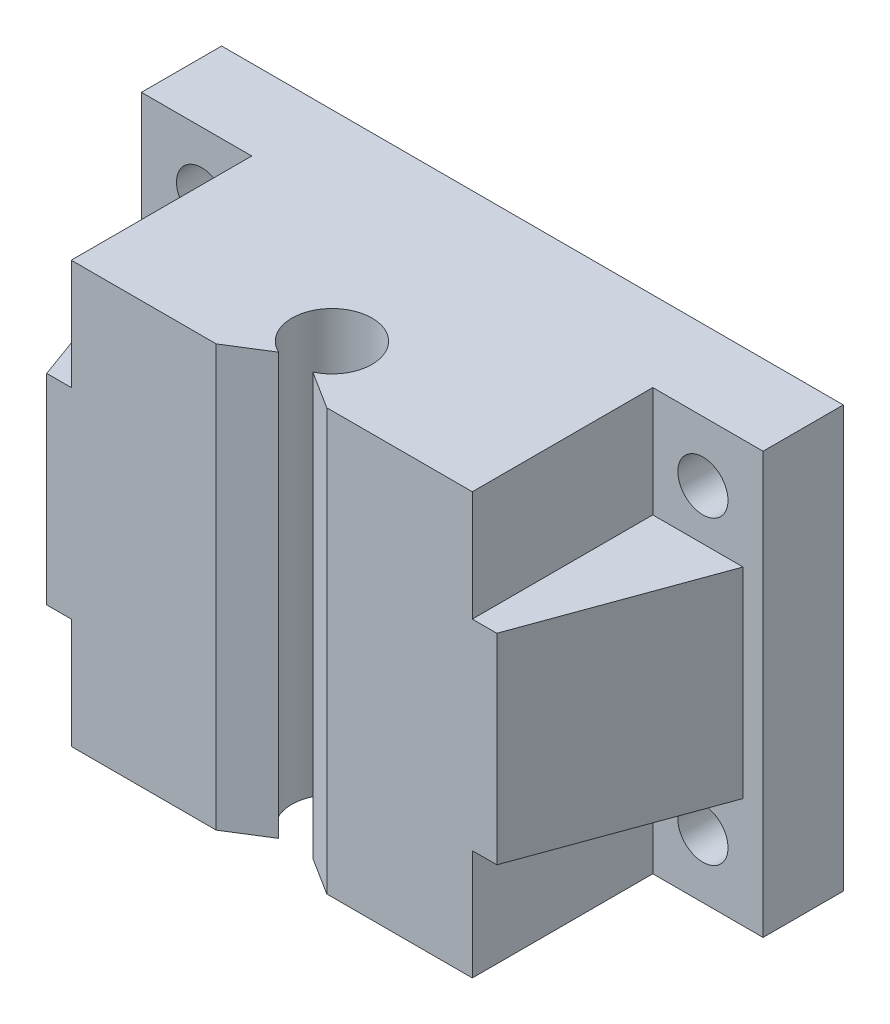
ISO-10303-21;
HEADER;
FILE_DESCRIPTION(('STEP AP214'),'2;1');
FILE_NAME('part.step','',(''),(''),'','','');
FILE_SCHEMA(('AUTOMOTIVE_DESIGN { 1 0 10303 214 1 1 1 1 }'));
ENDSEC;
DATA;
#1=APPLICATION_CONTEXT('core data for automotive mechanical design processes');
#2=APPLICATION_PROTOCOL_DEFINITION('international standard','automotive_design',2000,#1);
#3=PRODUCT_CONTEXT('',#1,'mechanical');
#4=PRODUCT('Part','Part','',(#3));
#5=PRODUCT_RELATED_PRODUCT_CATEGORY('part','',(#4));
#6=PRODUCT_DEFINITION_FORMATION('','',#4);
#7=PRODUCT_DEFINITION_CONTEXT('part definition',#1,'design');
#8=PRODUCT_DEFINITION('design','',#6,#7);
#9=PRODUCT_DEFINITION_SHAPE('','',#8);
#10=(LENGTH_UNIT() NAMED_UNIT(*) SI_UNIT(.MILLI.,.METRE.));
#11=(NAMED_UNIT(*) PLANE_ANGLE_UNIT() SI_UNIT($,.RADIAN.));
#12=(NAMED_UNIT(*) SI_UNIT($,.STERADIAN.) SOLID_ANGLE_UNIT());
#13=UNCERTAINTY_MEASURE_WITH_UNIT(LENGTH_MEASURE(1.E-05),#10,'distance_accuracy_value','');
#14=(GEOMETRIC_REPRESENTATION_CONTEXT(3) GLOBAL_UNCERTAINTY_ASSIGNED_CONTEXT((#13)) GLOBAL_UNIT_ASSIGNED_CONTEXT((#10,
#11,#12)) REPRESENTATION_CONTEXT('',''));
#15=CARTESIAN_POINT('',(0.,0.,0.));
#16=DIRECTION('',(0.,0.,1.));
#17=DIRECTION('',(1.,0.,0.));
#18=AXIS2_PLACEMENT_3D('',#15,#16,#17);
#19=CARTESIAN_POINT('',(-20.,-21.,0.));
#20=DIRECTION('',(-1.,0.,0.));
#21=DIRECTION('',(0.,0.,1.));
#22=AXIS2_PLACEMENT_3D('',#19,#20,#21);
#23=PLANE('',#22);
#24=DIRECTION('',(0.,1.,0.));
#25=VECTOR('',#24,1.);
#26=CARTESIAN_POINT('',(-20.,-21.,22.));
#27=LINE('',#26,#25);
#28=CARTESIAN_POINT('',(-20.,-21.,22.));
#29=VERTEX_POINT('',#28);
#30=CARTESIAN_POINT('',(-20.,-10.,22.));
#31=VERTEX_POINT('',#30);
#32=EDGE_CURVE('E64',#29,#31,#27,.T.);
#33=ORIENTED_EDGE('',*,*,#32,.T.);
#34=DIRECTION('',(0.,0.,1.));
#35=VECTOR('',#34,1.);
#36=CARTESIAN_POINT('',(-20.,-10.,0.));
#37=LINE('',#36,#35);
#38=CARTESIAN_POINT('',(-20.,-10.,4.));
#39=VERTEX_POINT('',#38);
#40=EDGE_CURVE('E214',#39,#31,#37,.T.);
#41=ORIENTED_EDGE('',*,*,#40,.F.);
#42=DIRECTION('',(0.,1.,0.));
#43=VECTOR('',#42,1.);
#44=CARTESIAN_POINT('',(-20.,-21.,4.));
#45=LINE('',#44,#43);
#46=CARTESIAN_POINT('',(-20.,-21.,4.));
#47=VERTEX_POINT('',#46);
#48=EDGE_CURVE('E313',#47,#39,#45,.T.);
#49=ORIENTED_EDGE('',*,*,#48,.F.);
#50=DIRECTION('',(0.,0.,1.));
#51=VECTOR('',#50,1.);
#52=CARTESIAN_POINT('',(-20.,-21.,0.));
#53=LINE('',#52,#51);
#54=EDGE_CURVE('E304',#47,#29,#53,.T.);
#55=ORIENTED_EDGE('',*,*,#54,.T.);
#56=EDGE_LOOP('',(#33,#41,#49,#55));
#57=FACE_BOUND('',#56,.T.);
#58=ADVANCED_FACE('F39',(#57),#23,.T.);
#59=CARTESIAN_POINT('',(0.,-21.,4.));
#60=DIRECTION('',(0.,0.,1.));
#61=DIRECTION('',(1.,0.,0.));
#62=AXIS2_PLACEMENT_3D('',#59,#60,#61);
#63=PLANE('',#62);
#64=CARTESIAN_POINT('',(-25.,15.,4.));
#65=DIRECTION('',(0.,0.,1.));
#66=DIRECTION('',(1.,0.,0.));
#67=AXIS2_PLACEMENT_3D('',#64,#65,#66);
#68=CIRCLE('',#67,2.5);
#69=CARTESIAN_POINT('',(-22.5,15.,4.));
#70=VERTEX_POINT('',#69);
#71=EDGE_CURVE('E562',#70,#70,#68,.F.);
#72=ORIENTED_EDGE('',*,*,#71,.T.);
#73=EDGE_LOOP('',(#72));
#74=FACE_BOUND('',#73,.T.);
#75=CARTESIAN_POINT('',(-25.,-15.,4.));
#76=DIRECTION('',(0.,0.,1.));
#77=DIRECTION('',(1.,0.,0.));
#78=AXIS2_PLACEMENT_3D('',#75,#76,#77);
#79=CIRCLE('',#78,2.5);
#80=CARTESIAN_POINT('',(-22.5,-15.,4.));
#81=VERTEX_POINT('',#80);
#82=EDGE_CURVE('E571',#81,#81,#79,.F.);
#83=ORIENTED_EDGE('',*,*,#82,.T.);
#84=EDGE_LOOP('',(#83));
#85=FACE_BOUND('',#84,.T.);
#86=ORIENTED_EDGE('',*,*,#48,.T.);
#87=DIRECTION('',(1.,0.,0.));
#88=VECTOR('',#87,1.);
#89=CARTESIAN_POINT('',(0.,-10.,4.));
#90=LINE('',#89,#88);
#91=CARTESIAN_POINT('',(-29.,-10.,4.));
#92=VERTEX_POINT('',#91);
#93=EDGE_CURVE('E191',#92,#39,#90,.T.);
#94=ORIENTED_EDGE('',*,*,#93,.F.);
#95=DIRECTION('',(0.,1.,0.));
#96=VECTOR('',#95,1.);
#97=CARTESIAN_POINT('',(-29.,-10.,4.));
#98=LINE('',#97,#96);
#99=CARTESIAN_POINT('',(-29.,10.,4.));
#100=VERTEX_POINT('',#99);
#101=EDGE_CURVE('E190',#92,#100,#98,.T.);
#102=ORIENTED_EDGE('',*,*,#101,.T.);
#103=DIRECTION('',(1.,0.,0.));
#104=VECTOR('',#103,1.);
#105=CARTESIAN_POINT('',(0.,10.,4.));
#106=LINE('',#105,#104);
#107=CARTESIAN_POINT('',(-20.,9.99999999999999,4.));
#108=VERTEX_POINT('',#107);
#109=EDGE_CURVE('E201',#100,#108,#106,.T.);
#110=ORIENTED_EDGE('',*,*,#109,.T.);
#111=CARTESIAN_POINT('',(-20.,21.,4.));
#112=VERTEX_POINT('',#111);
#113=EDGE_CURVE('E316',#108,#112,#45,.T.);
#114=ORIENTED_EDGE('',*,*,#113,.T.);
#115=DIRECTION('',(1.,0.,0.));
#116=VECTOR('',#115,1.);
#117=CARTESIAN_POINT('',(0.,21.,4.));
#118=LINE('',#117,#116);
#119=CARTESIAN_POINT('',(-31.,21.,4.));
#120=VERTEX_POINT('',#119);
#121=EDGE_CURVE('E268',#120,#112,#118,.T.);
#122=ORIENTED_EDGE('',*,*,#121,.F.);
#123=DIRECTION('',(0.,1.,0.));
#124=VECTOR('',#123,1.);
#125=CARTESIAN_POINT('',(-31.,-21.,4.));
#126=LINE('',#125,#124);
#127=CARTESIAN_POINT('',(-31.,-21.,4.));
#128=VERTEX_POINT('',#127);
#129=EDGE_CURVE('E317',#128,#120,#126,.T.);
#130=ORIENTED_EDGE('',*,*,#129,.F.);
#131=DIRECTION('',(1.,0.,0.));
#132=VECTOR('',#131,1.);
#133=CARTESIAN_POINT('',(0.,-21.,4.));
#134=LINE('',#133,#132);
#135=EDGE_CURVE('E301',#128,#47,#134,.T.);
#136=ORIENTED_EDGE('',*,*,#135,.T.);
#137=EDGE_LOOP('',(#86,#94,#102,#110,#114,#122,#130,#136));
#138=FACE_BOUND('',#137,.T.);
#139=ADVANCED_FACE('F385',(#74,#85,#138),#63,.T.);
#140=CARTESIAN_POINT('',(0.,-21.,4.));
#141=DIRECTION('',(0.,0.,1.));
#142=DIRECTION('',(1.,0.,0.));
#143=AXIS2_PLACEMENT_3D('',#140,#141,#142);
#144=PLANE('',#143);
#145=CARTESIAN_POINT('',(25.,-15.,4.));
#146=DIRECTION('',(0.,0.,1.));
#147=DIRECTION('',(1.,0.,0.));
#148=AXIS2_PLACEMENT_3D('',#145,#146,#147);
#149=CIRCLE('',#148,2.5);
#150=CARTESIAN_POINT('',(27.5,-15.,4.));
#151=VERTEX_POINT('',#150);
#152=EDGE_CURVE('E576',#151,#151,#149,.F.);
#153=ORIENTED_EDGE('',*,*,#152,.T.);
#154=EDGE_LOOP('',(#153));
#155=FACE_BOUND('',#154,.T.);
#156=CARTESIAN_POINT('',(25.,15.,4.));
#157=DIRECTION('',(0.,0.,1.));
#158=DIRECTION('',(1.,0.,0.));
#159=AXIS2_PLACEMENT_3D('',#156,#157,#158);
#160=CIRCLE('',#159,2.5);
#161=CARTESIAN_POINT('',(27.5,15.,4.));
#162=VERTEX_POINT('',#161);
#163=EDGE_CURVE('E205',#162,#162,#160,.F.);
#164=ORIENTED_EDGE('',*,*,#163,.T.);
#165=EDGE_LOOP('',(#164));
#166=FACE_BOUND('',#165,.T.);
#167=DIRECTION('',(0.,1.,0.));
#168=VECTOR('',#167,1.);
#169=CARTESIAN_POINT('',(29.,-10.,4.));
#170=LINE('',#169,#168);
#171=CARTESIAN_POINT('',(29.,-10.,4.));
#172=VERTEX_POINT('',#171);
#173=CARTESIAN_POINT('',(29.,10.,4.));
#174=VERTEX_POINT('',#173);
#175=EDGE_CURVE('E241',#172,#174,#170,.T.);
#176=ORIENTED_EDGE('',*,*,#175,.F.);
#177=DIRECTION('',(1.,0.,0.));
#178=VECTOR('',#177,1.);
#179=CARTESIAN_POINT('',(0.,-10.,4.));
#180=LINE('',#179,#178);
#181=CARTESIAN_POINT('',(20.,-10.,4.));
#182=VERTEX_POINT('',#181);
#183=EDGE_CURVE('E238',#182,#172,#180,.T.);
#184=ORIENTED_EDGE('',*,*,#183,.F.);
#185=DIRECTION('',(0.,1.,0.));
#186=VECTOR('',#185,1.);
#187=CARTESIAN_POINT('',(20.,-21.,4.));
#188=LINE('',#187,#186);
#189=CARTESIAN_POINT('',(20.,-21.,4.));
#190=VERTEX_POINT('',#189);
#191=EDGE_CURVE('E325',#190,#182,#188,.T.);
#192=ORIENTED_EDGE('',*,*,#191,.F.);
#193=DIRECTION('',(1.,0.,0.));
#194=VECTOR('',#193,1.);
#195=CARTESIAN_POINT('',(0.,-21.,4.));
#196=LINE('',#195,#194);
#197=CARTESIAN_POINT('',(31.,-21.,4.));
#198=VERTEX_POINT('',#197);
#199=EDGE_CURVE('E291',#190,#198,#196,.T.);
#200=ORIENTED_EDGE('',*,*,#199,.T.);
#201=DIRECTION('',(0.,1.,0.));
#202=VECTOR('',#201,1.);
#203=CARTESIAN_POINT('',(31.,-21.,4.));
#204=LINE('',#203,#202);
#205=CARTESIAN_POINT('',(31.,21.,4.));
#206=VERTEX_POINT('',#205);
#207=EDGE_CURVE('E323',#198,#206,#204,.T.);
#208=ORIENTED_EDGE('',*,*,#207,.T.);
#209=DIRECTION('',(1.,0.,0.));
#210=VECTOR('',#209,1.);
#211=CARTESIAN_POINT('',(0.,21.,4.));
#212=LINE('',#211,#210);
#213=CARTESIAN_POINT('',(20.,21.,4.));
#214=VERTEX_POINT('',#213);
#215=EDGE_CURVE('E256',#214,#206,#212,.T.);
#216=ORIENTED_EDGE('',*,*,#215,.F.);
#217=CARTESIAN_POINT('',(20.,10.,4.));
#218=VERTEX_POINT('',#217);
#219=EDGE_CURVE('E328',#218,#214,#188,.T.);
#220=ORIENTED_EDGE('',*,*,#219,.F.);
#221=DIRECTION('',(1.,0.,0.));
#222=VECTOR('',#221,1.);
#223=CARTESIAN_POINT('',(0.,10.,4.));
#224=LINE('',#223,#222);
#225=EDGE_CURVE('E227',#218,#174,#224,.T.);
#226=ORIENTED_EDGE('',*,*,#225,.T.);
#227=EDGE_LOOP('',(#176,#184,#192,#200,#208,#216,#220,#226));
#228=FACE_BOUND('',#227,.T.);
#229=ADVANCED_FACE('F367',(#155,#166,#228),#144,.T.);
#230=CARTESIAN_POINT('',(20.,-21.,0.));
#231=DIRECTION('',(-1.,0.,0.));
#232=DIRECTION('',(0.,0.,1.));
#233=AXIS2_PLACEMENT_3D('',#230,#231,#232);
#234=PLANE('',#233);
#235=DIRECTION('',(0.,0.,1.));
#236=VECTOR('',#235,1.);
#237=CARTESIAN_POINT('',(20.,-10.,0.));
#238=LINE('',#237,#236);
#239=CARTESIAN_POINT('',(20.,-10.,22.));
#240=VERTEX_POINT('',#239);
#241=EDGE_CURVE('E230',#182,#240,#238,.T.);
#242=ORIENTED_EDGE('',*,*,#241,.T.);
#243=DIRECTION('',(0.,1.,0.));
#244=VECTOR('',#243,1.);
#245=CARTESIAN_POINT('',(20.,-21.,22.));
#246=LINE('',#245,#244);
#247=CARTESIAN_POINT('',(20.,-21.,22.));
#248=VERTEX_POINT('',#247);
#249=EDGE_CURVE('E329',#248,#240,#246,.T.);
#250=ORIENTED_EDGE('',*,*,#249,.F.);
#251=DIRECTION('',(0.,0.,1.));
#252=VECTOR('',#251,1.);
#253=CARTESIAN_POINT('',(20.,-21.,0.));
#254=LINE('',#253,#252);
#255=EDGE_CURVE('E289',#190,#248,#254,.T.);
#256=ORIENTED_EDGE('',*,*,#255,.F.);
#257=ORIENTED_EDGE('',*,*,#191,.T.);
#258=EDGE_LOOP('',(#242,#250,#256,#257));
#259=FACE_BOUND('',#258,.T.);
#260=ADVANCED_FACE('F405',(#259),#234,.F.);
#261=CARTESIAN_POINT('',(0.,-21.,16.));
#262=DIRECTION('',(0.,1.,0.));
#263=DIRECTION('',(0.,0.,1.));
#264=AXIS2_PLACEMENT_3D('',#261,#262,#263);
#265=CYLINDRICAL_SURFACE('',#264,4.);
#266=DIRECTION('',(0.,1.,0.));
#267=VECTOR('',#266,1.);
#268=CARTESIAN_POINT('',(1.70882809611771,-21.,19.6166153428197));
#269=LINE('',#268,#267);
#270=CARTESIAN_POINT('',(1.70882809611771,-21.,19.6166153428197));
#271=VERTEX_POINT('',#270);
#272=CARTESIAN_POINT('',(1.70882809611771,21.,19.6166153428197));
#273=VERTEX_POINT('',#272);
#274=EDGE_CURVE('E43',#271,#273,#269,.T.);
#275=ORIENTED_EDGE('',*,*,#274,.T.);
#276=CARTESIAN_POINT('',(0.,21.,16.));
#277=DIRECTION('',(0.,1.,0.));
#278=DIRECTION('',(0.,0.,1.));
#279=AXIS2_PLACEMENT_3D('',#276,#277,#278);
#280=CIRCLE('',#279,4.);
#281=CARTESIAN_POINT('',(-1.72457910656757,21.,19.6091310457215));
#282=VERTEX_POINT('',#281);
#283=EDGE_CURVE('E243',#273,#282,#280,.T.);
#284=ORIENTED_EDGE('',*,*,#283,.T.);
#285=DIRECTION('',(0.,1.,0.));
#286=VECTOR('',#285,1.);
#287=CARTESIAN_POINT('',(-1.72457910656757,-21.,19.6091310457215));
#288=LINE('',#287,#286);
#289=CARTESIAN_POINT('',(-1.72457910656757,-21.,19.6091310457215));
#290=VERTEX_POINT('',#289);
#291=EDGE_CURVE('E11',#290,#282,#288,.T.);
#292=ORIENTED_EDGE('',*,*,#291,.F.);
#293=CARTESIAN_POINT('',(0.,-21.,16.));
#294=DIRECTION('',(0.,1.,0.));
#295=DIRECTION('',(0.,0.,1.));
#296=AXIS2_PLACEMENT_3D('',#293,#294,#295);
#297=CIRCLE('',#296,4.);
#298=EDGE_CURVE('E280',#271,#290,#297,.T.);
#299=ORIENTED_EDGE('',*,*,#298,.F.);
#300=EDGE_LOOP('',(#275,#284,#292,#299));
#301=FACE_BOUND('',#300,.T.);
#302=ADVANCED_FACE('F41',(#301),#265,.F.);
#303=CARTESIAN_POINT('',(8.3312649876136,-21.,13.3190503029269));
#304=DIRECTION('',(-0.530312841304763,0.,-0.847802034880354));
#305=DIRECTION('',(-0.847802034880354,0.,0.530312841304763));
#306=AXIS2_PLACEMENT_3D('',#303,#304,#305);
#307=PLANE('',#306);
#308=ORIENTED_EDGE('',*,*,#291,.T.);
#309=DIRECTION('',(-0.847802034880354,0.,0.530312841304763));
#310=VECTOR('',#309,1.);
#311=CARTESIAN_POINT('',(8.3312649876136,21.,13.3190503029269));
#312=LINE('',#311,#310);
#313=CARTESIAN_POINT('',(-5.54682025687137,21.,22.));
#314=VERTEX_POINT('',#313);
#315=EDGE_CURVE('E277',#282,#314,#312,.T.);
#316=ORIENTED_EDGE('',*,*,#315,.T.);
#317=DIRECTION('',(0.,1.,0.));
#318=VECTOR('',#317,1.);
#319=CARTESIAN_POINT('',(-5.54682025687137,-21.,22.));
#320=LINE('',#319,#318);
#321=CARTESIAN_POINT('',(-5.54682025687137,-21.,22.));
#322=VERTEX_POINT('',#321);
#323=EDGE_CURVE('E48',#322,#314,#320,.T.);
#324=ORIENTED_EDGE('',*,*,#323,.F.);
#325=DIRECTION('',(-0.847802034880354,0.,0.530312841304763));
#326=VECTOR('',#325,1.);
#327=CARTESIAN_POINT('',(8.3312649876136,-21.,13.3190503029269));
#328=LINE('',#327,#326);
#329=EDGE_CURVE('E309',#290,#322,#328,.T.);
#330=ORIENTED_EDGE('',*,*,#329,.F.);
#331=EDGE_LOOP('',(#308,#316,#324,#330));
#332=FACE_BOUND('',#331,.T.);
#333=ADVANCED_FACE('F347',(#332),#307,.F.);
#334=CARTESIAN_POINT('',(0.,-21.,22.));
#335=DIRECTION('',(0.,0.,1.));
#336=DIRECTION('',(1.,0.,0.));
#337=AXIS2_PLACEMENT_3D('',#334,#335,#336);
#338=PLANE('',#337);
#339=ORIENTED_EDGE('',*,*,#323,.T.);
#340=DIRECTION('',(1.,0.,0.));
#341=VECTOR('',#340,1.);
#342=CARTESIAN_POINT('',(0.,21.,22.));
#343=LINE('',#342,#341);
#344=CARTESIAN_POINT('',(-20.,21.,22.));
#345=VERTEX_POINT('',#344);
#346=EDGE_CURVE('E274',#345,#314,#343,.T.);
#347=ORIENTED_EDGE('',*,*,#346,.F.);
#348=CARTESIAN_POINT('',(-20.,9.99999999999999,22.));
#349=VERTEX_POINT('',#348);
#350=EDGE_CURVE('E197',#349,#345,#27,.T.);
#351=ORIENTED_EDGE('',*,*,#350,.F.);
#352=DIRECTION('',(1.,0.,0.));
#353=VECTOR('',#352,1.);
#354=CARTESIAN_POINT('',(0.,10.,22.));
#355=LINE('',#354,#353);
#356=CARTESIAN_POINT('',(-22.4485357832084,10.,22.));
#357=VERTEX_POINT('',#356);
#358=EDGE_CURVE('E194',#357,#349,#355,.T.);
#359=ORIENTED_EDGE('',*,*,#358,.F.);
#360=DIRECTION('',(0.,1.,0.));
#361=VECTOR('',#360,1.);
#362=CARTESIAN_POINT('',(-22.4485357832084,-10.,22.));
#363=LINE('',#362,#361);
#364=CARTESIAN_POINT('',(-22.4485357832084,-10.,22.));
#365=VERTEX_POINT('',#364);
#366=EDGE_CURVE('E178',#365,#357,#363,.T.);
#367=ORIENTED_EDGE('',*,*,#366,.F.);
#368=DIRECTION('',(1.,0.,0.));
#369=VECTOR('',#368,1.);
#370=CARTESIAN_POINT('',(0.,-10.,22.));
#371=LINE('',#370,#369);
#372=EDGE_CURVE('E212',#365,#31,#371,.T.);
#373=ORIENTED_EDGE('',*,*,#372,.T.);
#374=ORIENTED_EDGE('',*,*,#32,.F.);
#375=DIRECTION('',(1.,0.,0.));
#376=VECTOR('',#375,1.);
#377=CARTESIAN_POINT('',(0.,-21.,22.));
#378=LINE('',#377,#376);
#379=EDGE_CURVE('E306',#29,#322,#378,.T.);
#380=ORIENTED_EDGE('',*,*,#379,.T.);
#381=EDGE_LOOP('',(#339,#347,#351,#359,#367,#373,#374,#380));
#382=FACE_BOUND('',#381,.T.);
#383=ADVANCED_FACE('F195',(#382),#338,.T.);
#384=DIRECTION('',(0.,0.,1.));
#385=VECTOR('',#384,1.);
#386=CARTESIAN_POINT('',(-20.,10.,0.));
#387=LINE('',#386,#385);
#388=EDGE_CURVE('E56',#108,#349,#387,.T.);
#389=ORIENTED_EDGE('',*,*,#388,.T.);
#390=ORIENTED_EDGE('',*,*,#350,.T.);
#391=DIRECTION('',(0.,0.,1.));
#392=VECTOR('',#391,1.);
#393=CARTESIAN_POINT('',(-20.,21.,0.));
#394=LINE('',#393,#392);
#395=EDGE_CURVE('E271',#112,#345,#394,.T.);
#396=ORIENTED_EDGE('',*,*,#395,.F.);
#397=ORIENTED_EDGE('',*,*,#113,.F.);
#398=EDGE_LOOP('',(#389,#390,#396,#397));
#399=FACE_BOUND('',#398,.T.);
#400=ADVANCED_FACE('F387',(#399),#23,.T.);
#401=CARTESIAN_POINT('',(-31.,-21.,0.));
#402=DIRECTION('',(1.,0.,0.));
#403=DIRECTION('',(0.,0.,-1.));
#404=AXIS2_PLACEMENT_3D('',#401,#402,#403);
#405=PLANE('',#404);
#406=ORIENTED_EDGE('',*,*,#129,.T.);
#407=DIRECTION('',(0.,0.,-1.));
#408=VECTOR('',#407,1.);
#409=CARTESIAN_POINT('',(-31.,21.,0.));
#410=LINE('',#409,#408);
#411=CARTESIAN_POINT('',(-31.,21.,-4.));
#412=VERTEX_POINT('',#411);
#413=EDGE_CURVE('E265',#120,#412,#410,.T.);
#414=ORIENTED_EDGE('',*,*,#413,.T.);
#415=DIRECTION('',(0.,1.,0.));
#416=VECTOR('',#415,1.);
#417=CARTESIAN_POINT('',(-31.,-21.,-4.));
#418=LINE('',#417,#416);
#419=CARTESIAN_POINT('',(-31.,-21.,-4.));
#420=VERTEX_POINT('',#419);
#421=EDGE_CURVE('E319',#420,#412,#418,.T.);
#422=ORIENTED_EDGE('',*,*,#421,.F.);
#423=DIRECTION('',(0.,0.,-1.));
#424=VECTOR('',#423,1.);
#425=CARTESIAN_POINT('',(-31.,-21.,0.));
#426=LINE('',#425,#424);
#427=EDGE_CURVE('E299',#128,#420,#426,.T.);
#428=ORIENTED_EDGE('',*,*,#427,.F.);
#429=EDGE_LOOP('',(#406,#414,#422,#428));
#430=FACE_BOUND('',#429,.T.);
#431=ADVANCED_FACE('F380',(#430),#405,.F.);
#432=CARTESIAN_POINT('',(0.,-21.,-4.));
#433=DIRECTION('',(0.,0.,1.));
#434=DIRECTION('',(1.,0.,0.));
#435=AXIS2_PLACEMENT_3D('',#432,#433,#434);
#436=PLANE('',#435);
#437=CARTESIAN_POINT('',(-25.,15.,-4.));
#438=DIRECTION('',(0.,0.,-1.));
#439=DIRECTION('',(-1.,0.,0.));
#440=AXIS2_PLACEMENT_3D('',#437,#438,#439);
#441=CIRCLE('',#440,2.5);
#442=CARTESIAN_POINT('',(-27.5,15.,-4.));
#443=VERTEX_POINT('',#442);
#444=EDGE_CURVE('E565',#443,#443,#441,.T.);
#445=ORIENTED_EDGE('',*,*,#444,.F.);
#446=EDGE_LOOP('',(#445));
#447=FACE_BOUND('',#446,.T.);
#448=CARTESIAN_POINT('',(25.,-15.,-4.));
#449=DIRECTION('',(0.,0.,-1.));
#450=DIRECTION('',(-1.,0.,0.));
#451=AXIS2_PLACEMENT_3D('',#448,#449,#450);
#452=CIRCLE('',#451,2.5);
#453=CARTESIAN_POINT('',(22.5,-15.,-4.));
#454=VERTEX_POINT('',#453);
#455=EDGE_CURVE('E568',#454,#454,#452,.T.);
#456=ORIENTED_EDGE('',*,*,#455,.F.);
#457=EDGE_LOOP('',(#456));
#458=FACE_BOUND('',#457,.T.);
#459=CARTESIAN_POINT('',(-25.,-15.,-4.));
#460=DIRECTION('',(0.,0.,-1.));
#461=DIRECTION('',(-1.,0.,0.));
#462=AXIS2_PLACEMENT_3D('',#459,#460,#461);
#463=CIRCLE('',#462,2.5);
#464=CARTESIAN_POINT('',(-27.5,-15.,-4.));
#465=VERTEX_POINT('',#464);
#466=EDGE_CURVE('E578',#465,#465,#463,.T.);
#467=ORIENTED_EDGE('',*,*,#466,.F.);
#468=EDGE_LOOP('',(#467));
#469=FACE_BOUND('',#468,.T.);
#470=CARTESIAN_POINT('',(25.,15.,-4.));
#471=DIRECTION('',(0.,0.,-1.));
#472=DIRECTION('',(-1.,0.,0.));
#473=AXIS2_PLACEMENT_3D('',#470,#471,#472);
#474=CIRCLE('',#473,2.5);
#475=CARTESIAN_POINT('',(22.5,15.,-4.));
#476=VERTEX_POINT('',#475);
#477=EDGE_CURVE('E202',#476,#476,#474,.T.);
#478=ORIENTED_EDGE('',*,*,#477,.F.);
#479=EDGE_LOOP('',(#478));
#480=FACE_BOUND('',#479,.T.);
#481=ORIENTED_EDGE('',*,*,#421,.T.);
#482=DIRECTION('',(1.,0.,0.));
#483=VECTOR('',#482,1.);
#484=CARTESIAN_POINT('',(0.,21.,-4.));
#485=LINE('',#484,#483);
#486=CARTESIAN_POINT('',(31.,21.,-4.));
#487=VERTEX_POINT('',#486);
#488=EDGE_CURVE('E262',#412,#487,#485,.T.);
#489=ORIENTED_EDGE('',*,*,#488,.T.);
#490=DIRECTION('',(0.,1.,0.));
#491=VECTOR('',#490,1.);
#492=CARTESIAN_POINT('',(31.,-21.,-4.));
#493=LINE('',#492,#491);
#494=CARTESIAN_POINT('',(31.,-21.,-4.));
#495=VERTEX_POINT('',#494);
#496=EDGE_CURVE('E321',#495,#487,#493,.T.);
#497=ORIENTED_EDGE('',*,*,#496,.F.);
#498=DIRECTION('',(1.,0.,0.));
#499=VECTOR('',#498,1.);
#500=CARTESIAN_POINT('',(0.,-21.,-4.));
#501=LINE('',#500,#499);
#502=EDGE_CURVE('E297',#420,#495,#501,.T.);
#503=ORIENTED_EDGE('',*,*,#502,.F.);
#504=EDGE_LOOP('',(#481,#489,#497,#503));
#505=FACE_BOUND('',#504,.T.);
#506=ADVANCED_FACE('F376',(#447,#458,#469,#480,#505),#436,.F.);
#507=CARTESIAN_POINT('',(31.,-21.,0.));
#508=DIRECTION('',(1.,0.,0.));
#509=DIRECTION('',(0.,0.,-1.));
#510=AXIS2_PLACEMENT_3D('',#507,#508,#509);
#511=PLANE('',#510);
#512=ORIENTED_EDGE('',*,*,#496,.T.);
#513=DIRECTION('',(0.,0.,-1.));
#514=VECTOR('',#513,1.);
#515=CARTESIAN_POINT('',(31.,21.,0.));
#516=LINE('',#515,#514);
#517=EDGE_CURVE('E259',#206,#487,#516,.T.);
#518=ORIENTED_EDGE('',*,*,#517,.F.);
#519=ORIENTED_EDGE('',*,*,#207,.F.);
#520=DIRECTION('',(0.,0.,-1.));
#521=VECTOR('',#520,1.);
#522=CARTESIAN_POINT('',(31.,-21.,0.));
#523=LINE('',#522,#521);
#524=EDGE_CURVE('E294',#198,#495,#523,.T.);
#525=ORIENTED_EDGE('',*,*,#524,.T.);
#526=EDGE_LOOP('',(#512,#518,#519,#525));
#527=FACE_BOUND('',#526,.T.);
#528=ADVANCED_FACE('F371',(#527),#511,.T.);
#529=CARTESIAN_POINT('',(20.,9.99999999999999,22.));
#530=VERTEX_POINT('',#529);
#531=CARTESIAN_POINT('',(20.,21.,22.));
#532=VERTEX_POINT('',#531);
#533=EDGE_CURVE('E331',#530,#532,#246,.T.);
#534=ORIENTED_EDGE('',*,*,#533,.F.);
#535=DIRECTION('',(0.,0.,1.));
#536=VECTOR('',#535,1.);
#537=CARTESIAN_POINT('',(20.,10.,0.));
#538=LINE('',#537,#536);
#539=EDGE_CURVE('E218',#218,#530,#538,.T.);
#540=ORIENTED_EDGE('',*,*,#539,.F.);
#541=ORIENTED_EDGE('',*,*,#219,.T.);
#542=DIRECTION('',(0.,0.,1.));
#543=VECTOR('',#542,1.);
#544=CARTESIAN_POINT('',(20.,21.,0.));
#545=LINE('',#544,#543);
#546=EDGE_CURVE('E253',#214,#532,#545,.T.);
#547=ORIENTED_EDGE('',*,*,#546,.T.);
#548=EDGE_LOOP('',(#534,#540,#541,#547));
#549=FACE_BOUND('',#548,.T.);
#550=ADVANCED_FACE('F361',(#549),#234,.F.);
#551=CARTESIAN_POINT('',(0.,-21.,22.));
#552=DIRECTION('',(0.,0.,1.));
#553=DIRECTION('',(1.,0.,0.));
#554=AXIS2_PLACEMENT_3D('',#551,#552,#553);
#555=PLANE('',#554);
#556=ORIENTED_EDGE('',*,*,#249,.T.);
#557=DIRECTION('',(1.,0.,0.));
#558=VECTOR('',#557,1.);
#559=CARTESIAN_POINT('',(0.,-10.,22.));
#560=LINE('',#559,#558);
#561=CARTESIAN_POINT('',(22.4485357832084,-10.,22.));
#562=VERTEX_POINT('',#561);
#563=EDGE_CURVE('E233',#240,#562,#560,.T.);
#564=ORIENTED_EDGE('',*,*,#563,.T.);
#565=DIRECTION('',(0.,1.,0.));
#566=VECTOR('',#565,1.);
#567=CARTESIAN_POINT('',(22.4485357832084,-10.,22.));
#568=LINE('',#567,#566);
#569=CARTESIAN_POINT('',(22.4485357832084,10.,22.));
#570=VERTEX_POINT('',#569);
#571=EDGE_CURVE('E240',#562,#570,#568,.T.);
#572=ORIENTED_EDGE('',*,*,#571,.T.);
#573=DIRECTION('',(1.,0.,0.));
#574=VECTOR('',#573,1.);
#575=CARTESIAN_POINT('',(0.,10.,22.));
#576=LINE('',#575,#574);
#577=EDGE_CURVE('E221',#530,#570,#576,.T.);
#578=ORIENTED_EDGE('',*,*,#577,.F.);
#579=ORIENTED_EDGE('',*,*,#533,.T.);
#580=DIRECTION('',(1.,0.,0.));
#581=VECTOR('',#580,1.);
#582=CARTESIAN_POINT('',(0.,21.,22.));
#583=LINE('',#582,#581);
#584=CARTESIAN_POINT('',(5.48296118754163,21.,22.));
#585=VERTEX_POINT('',#584);
#586=EDGE_CURVE('E250',#585,#532,#583,.T.);
#587=ORIENTED_EDGE('',*,*,#586,.F.);
#588=DIRECTION('',(0.,1.,0.));
#589=VECTOR('',#588,1.);
#590=CARTESIAN_POINT('',(5.48296118754163,-21.,22.));
#591=LINE('',#590,#589);
#592=CARTESIAN_POINT('',(5.48296118754163,-21.,22.));
#593=VERTEX_POINT('',#592);
#594=EDGE_CURVE('E332',#593,#585,#591,.T.);
#595=ORIENTED_EDGE('',*,*,#594,.F.);
#596=DIRECTION('',(1.,0.,0.));
#597=VECTOR('',#596,1.);
#598=CARTESIAN_POINT('',(0.,-21.,22.));
#599=LINE('',#598,#597);
#600=EDGE_CURVE('E286',#593,#248,#599,.T.);
#601=ORIENTED_EDGE('',*,*,#600,.T.);
#602=EDGE_LOOP('',(#556,#564,#572,#578,#579,#587,#595,#601));
#603=FACE_BOUND('',#602,.T.);
#604=ADVANCED_FACE('F356',(#603),#555,.T.);
#605=CARTESIAN_POINT('',(-8.36897757936114,-21.,13.2524286956766));
#606=DIRECTION('',(-0.533948413836413,0.,0.84551705563021));
#607=DIRECTION('',(0.84551705563021,0.,0.533948413836413));
#608=AXIS2_PLACEMENT_3D('',#605,#606,#607);
#609=PLANE('',#608);
#610=ORIENTED_EDGE('',*,*,#594,.T.);
#611=DIRECTION('',(0.84551705563021,0.,0.533948413836413));
#612=VECTOR('',#611,1.);
#613=CARTESIAN_POINT('',(-8.36897757936114,21.,13.2524286956766));
#614=LINE('',#613,#612);
#615=EDGE_CURVE('E247',#273,#585,#614,.T.);
#616=ORIENTED_EDGE('',*,*,#615,.F.);
#617=ORIENTED_EDGE('',*,*,#274,.F.);
#618=DIRECTION('',(0.84551705563021,0.,0.533948413836413));
#619=VECTOR('',#618,1.);
#620=CARTESIAN_POINT('',(-8.36897757936114,-21.,13.2524286956766));
#621=LINE('',#620,#619);
#622=EDGE_CURVE('E283',#271,#593,#621,.T.);
#623=ORIENTED_EDGE('',*,*,#622,.T.);
#624=EDGE_LOOP('',(#610,#616,#617,#623));
#625=FACE_BOUND('',#624,.T.);
#626=ADVANCED_FACE('F341',(#625),#609,.T.);
#627=CARTESIAN_POINT('',(0.,-21.,0.));
#628=DIRECTION('',(0.,1.,0.));
#629=DIRECTION('',(0.,0.,1.));
#630=AXIS2_PLACEMENT_3D('',#627,#628,#629);
#631=PLANE('',#630);
#632=ORIENTED_EDGE('',*,*,#298,.T.);
#633=ORIENTED_EDGE('',*,*,#329,.T.);
#634=ORIENTED_EDGE('',*,*,#379,.F.);
#635=ORIENTED_EDGE('',*,*,#54,.F.);
#636=ORIENTED_EDGE('',*,*,#135,.F.);
#637=ORIENTED_EDGE('',*,*,#427,.T.);
#638=ORIENTED_EDGE('',*,*,#502,.T.);
#639=ORIENTED_EDGE('',*,*,#524,.F.);
#640=ORIENTED_EDGE('',*,*,#199,.F.);
#641=ORIENTED_EDGE('',*,*,#255,.T.);
#642=ORIENTED_EDGE('',*,*,#600,.F.);
#643=ORIENTED_EDGE('',*,*,#622,.F.);
#644=EDGE_LOOP('',(#632,#633,#634,#635,#636,#637,#638,#639,#640,#641,#642,#643));
#645=FACE_BOUND('',#644,.T.);
#646=ADVANCED_FACE('F350',(#645),#631,.F.);
#647=CARTESIAN_POINT('',(0.,21.,0.));
#648=DIRECTION('',(0.,1.,0.));
#649=DIRECTION('',(0.,0.,1.));
#650=AXIS2_PLACEMENT_3D('',#647,#648,#649);
#651=PLANE('',#650);
#652=ORIENTED_EDGE('',*,*,#283,.F.);
#653=ORIENTED_EDGE('',*,*,#615,.T.);
#654=ORIENTED_EDGE('',*,*,#586,.T.);
#655=ORIENTED_EDGE('',*,*,#546,.F.);
#656=ORIENTED_EDGE('',*,*,#215,.T.);
#657=ORIENTED_EDGE('',*,*,#517,.T.);
#658=ORIENTED_EDGE('',*,*,#488,.F.);
#659=ORIENTED_EDGE('',*,*,#413,.F.);
#660=ORIENTED_EDGE('',*,*,#121,.T.);
#661=ORIENTED_EDGE('',*,*,#395,.T.);
#662=ORIENTED_EDGE('',*,*,#346,.T.);
#663=ORIENTED_EDGE('',*,*,#315,.F.);
#664=EDGE_LOOP('',(#652,#653,#654,#655,#656,#657,#658,#659,#660,#661,#662,#663));
#665=FACE_BOUND('',#664,.T.);
#666=ADVANCED_FACE('F344',(#665),#651,.T.);
#667=CARTESIAN_POINT('',(26.8932196445983,-10.,9.7883314542168));
#668=DIRECTION('',(-0.939692620785909,0.,-0.342020143325666));
#669=DIRECTION('',(-0.342020143325666,0.,0.939692620785909));
#670=AXIS2_PLACEMENT_3D('',#667,#668,#669);
#671=PLANE('',#670);
#672=ORIENTED_EDGE('',*,*,#175,.T.);
#673=DIRECTION('',(-0.342020143325666,0.,0.93969262078591));
#674=VECTOR('',#673,1.);
#675=CARTESIAN_POINT('',(26.8932196445983,10.,9.7883314542168));
#676=LINE('',#675,#674);
#677=EDGE_CURVE('E224',#174,#570,#676,.T.);
#678=ORIENTED_EDGE('',*,*,#677,.T.);
#679=ORIENTED_EDGE('',*,*,#571,.F.);
#680=DIRECTION('',(-0.342020143325666,0.,0.93969262078591));
#681=VECTOR('',#680,1.);
#682=CARTESIAN_POINT('',(26.8932196445983,-10.,9.7883314542168));
#683=LINE('',#682,#681);
#684=EDGE_CURVE('E236',#172,#562,#683,.T.);
#685=ORIENTED_EDGE('',*,*,#684,.F.);
#686=EDGE_LOOP('',(#672,#678,#679,#685));
#687=FACE_BOUND('',#686,.T.);
#688=ADVANCED_FACE('F427',(#687),#671,.F.);
#689=CARTESIAN_POINT('',(0.,-10.,0.));
#690=DIRECTION('',(0.,1.,0.));
#691=DIRECTION('',(0.,0.,1.));
#692=AXIS2_PLACEMENT_3D('',#689,#690,#691);
#693=PLANE('',#692);
#694=ORIENTED_EDGE('',*,*,#241,.F.);
#695=ORIENTED_EDGE('',*,*,#183,.T.);
#696=ORIENTED_EDGE('',*,*,#684,.T.);
#697=ORIENTED_EDGE('',*,*,#563,.F.);
#698=EDGE_LOOP('',(#694,#695,#696,#697));
#699=FACE_BOUND('',#698,.T.);
#700=ADVANCED_FACE('F443',(#699),#693,.F.);
#701=CARTESIAN_POINT('',(0.,10.,0.));
#702=DIRECTION('',(0.,1.,0.));
#703=DIRECTION('',(0.,0.,1.));
#704=AXIS2_PLACEMENT_3D('',#701,#702,#703);
#705=PLANE('',#704);
#706=ORIENTED_EDGE('',*,*,#539,.T.);
#707=ORIENTED_EDGE('',*,*,#577,.T.);
#708=ORIENTED_EDGE('',*,*,#677,.F.);
#709=ORIENTED_EDGE('',*,*,#225,.F.);
#710=EDGE_LOOP('',(#706,#707,#708,#709));
#711=FACE_BOUND('',#710,.T.);
#712=ADVANCED_FACE('F449',(#711),#705,.T.);
#713=CARTESIAN_POINT('',(-26.8932196445983,-10.,9.78833145421678));
#714=DIRECTION('',(-0.939692620785909,0.,0.342020143325666));
#715=DIRECTION('',(0.342020143325666,0.,0.939692620785909));
#716=AXIS2_PLACEMENT_3D('',#713,#714,#715);
#717=PLANE('',#716);
#718=ORIENTED_EDGE('',*,*,#366,.T.);
#719=DIRECTION('',(0.342020143325666,0.,0.93969262078591));
#720=VECTOR('',#719,1.);
#721=CARTESIAN_POINT('',(-26.8932196445983,10.,9.78833145421678));
#722=LINE('',#721,#720);
#723=EDGE_CURVE('E183',#100,#357,#722,.T.);
#724=ORIENTED_EDGE('',*,*,#723,.F.);
#725=ORIENTED_EDGE('',*,*,#101,.F.);
#726=DIRECTION('',(0.342020143325666,0.,0.93969262078591));
#727=VECTOR('',#726,1.);
#728=CARTESIAN_POINT('',(-26.8932196445983,-10.,9.78833145421678));
#729=LINE('',#728,#727);
#730=EDGE_CURVE('E186',#92,#365,#729,.T.);
#731=ORIENTED_EDGE('',*,*,#730,.T.);
#732=EDGE_LOOP('',(#718,#724,#725,#731));
#733=FACE_BOUND('',#732,.T.);
#734=ADVANCED_FACE('F180',(#733),#717,.T.);
#735=CARTESIAN_POINT('',(0.,-10.,0.));
#736=DIRECTION('',(0.,1.,0.));
#737=DIRECTION('',(0.,0.,1.));
#738=AXIS2_PLACEMENT_3D('',#735,#736,#737);
#739=PLANE('',#738);
#740=ORIENTED_EDGE('',*,*,#730,.F.);
#741=ORIENTED_EDGE('',*,*,#93,.T.);
#742=ORIENTED_EDGE('',*,*,#40,.T.);
#743=ORIENTED_EDGE('',*,*,#372,.F.);
#744=EDGE_LOOP('',(#740,#741,#742,#743));
#745=FACE_BOUND('',#744,.T.);
#746=ADVANCED_FACE('F456',(#745),#739,.F.);
#747=CARTESIAN_POINT('',(0.,10.,0.));
#748=DIRECTION('',(0.,1.,0.));
#749=DIRECTION('',(0.,0.,1.));
#750=AXIS2_PLACEMENT_3D('',#747,#748,#749);
#751=PLANE('',#750);
#752=ORIENTED_EDGE('',*,*,#723,.T.);
#753=ORIENTED_EDGE('',*,*,#358,.T.);
#754=ORIENTED_EDGE('',*,*,#388,.F.);
#755=ORIENTED_EDGE('',*,*,#109,.F.);
#756=EDGE_LOOP('',(#752,#753,#754,#755));
#757=FACE_BOUND('',#756,.T.);
#758=ADVANCED_FACE('F200',(#757),#751,.T.);
#759=CARTESIAN_POINT('',(25.,15.,22.001));
#760=DIRECTION('',(0.,0.,-1.));
#761=DIRECTION('',(-1.,0.,0.));
#762=AXIS2_PLACEMENT_3D('',#759,#760,#761);
#763=CYLINDRICAL_SURFACE('',#762,2.5);
#764=ORIENTED_EDGE('',*,*,#163,.F.);
#765=EDGE_LOOP('',(#764));
#766=FACE_BOUND('',#765,.T.);
#767=ORIENTED_EDGE('',*,*,#477,.T.);
#768=EDGE_LOOP('',(#767));
#769=FACE_BOUND('',#768,.T.);
#770=ADVANCED_FACE('F496',(#766,#769),#763,.F.);
#771=CARTESIAN_POINT('',(-25.,-15.,22.001));
#772=DIRECTION('',(0.,0.,-1.));
#773=DIRECTION('',(-1.,0.,0.));
#774=AXIS2_PLACEMENT_3D('',#771,#772,#773);
#775=CYLINDRICAL_SURFACE('',#774,2.5);
#776=ORIENTED_EDGE('',*,*,#82,.F.);
#777=EDGE_LOOP('',(#776));
#778=FACE_BOUND('',#777,.T.);
#779=ORIENTED_EDGE('',*,*,#466,.T.);
#780=EDGE_LOOP('',(#779));
#781=FACE_BOUND('',#780,.T.);
#782=ADVANCED_FACE('F526',(#778,#781),#775,.F.);
#783=CARTESIAN_POINT('',(25.,-15.,22.001));
#784=DIRECTION('',(0.,0.,-1.));
#785=DIRECTION('',(-1.,0.,0.));
#786=AXIS2_PLACEMENT_3D('',#783,#784,#785);
#787=CYLINDRICAL_SURFACE('',#786,2.5);
#788=ORIENTED_EDGE('',*,*,#152,.F.);
#789=EDGE_LOOP('',(#788));
#790=FACE_BOUND('',#789,.T.);
#791=ORIENTED_EDGE('',*,*,#455,.T.);
#792=EDGE_LOOP('',(#791));
#793=FACE_BOUND('',#792,.T.);
#794=ADVANCED_FACE('F536',(#790,#793),#787,.F.);
#795=CARTESIAN_POINT('',(-25.,15.,22.001));
#796=DIRECTION('',(0.,0.,-1.));
#797=DIRECTION('',(-1.,0.,0.));
#798=AXIS2_PLACEMENT_3D('',#795,#796,#797);
#799=CYLINDRICAL_SURFACE('',#798,2.5);
#800=ORIENTED_EDGE('',*,*,#71,.F.);
#801=EDGE_LOOP('',(#800));
#802=FACE_BOUND('',#801,.T.);
#803=ORIENTED_EDGE('',*,*,#444,.T.);
#804=EDGE_LOOP('',(#803));
#805=FACE_BOUND('',#804,.T.);
#806=ADVANCED_FACE('F546',(#802,#805),#799,.F.);
#807=CLOSED_SHELL('',(#58,#139,#229,#260,#302,#333,#383,#400,#431,#506,#528,#550,#604,#626,#646,
#666,#688,#700,#712,#734,#746,#758,#770,#782,#794,#806));
#808=MANIFOLD_SOLID_BREP('B2',#807);
#809=ADVANCED_BREP_SHAPE_REPRESENTATION('',(#18,#808),#14);
#810=SHAPE_DEFINITION_REPRESENTATION(#9,#809);
ENDSEC;
END-ISO-10303-21;
